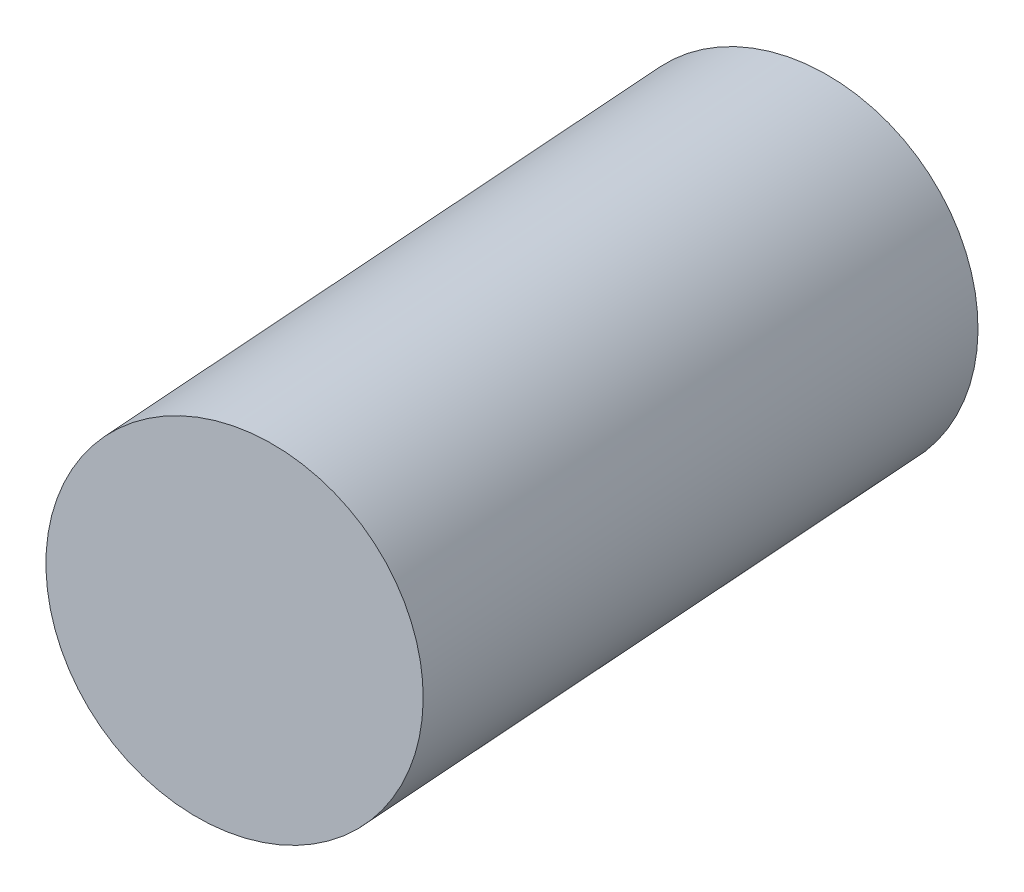
ISO-10303-21;
HEADER;
FILE_DESCRIPTION(('STEP AP214'),'2;1');
FILE_NAME('part.step','',(''),(''),'','','');
FILE_SCHEMA(('AUTOMOTIVE_DESIGN { 1 0 10303 214 1 1 1 1 }'));
ENDSEC;
DATA;
#1=APPLICATION_CONTEXT('core data for automotive mechanical design processes');
#2=APPLICATION_PROTOCOL_DEFINITION('international standard','automotive_design',2000,#1);
#3=PRODUCT_CONTEXT('',#1,'mechanical');
#4=PRODUCT('Part','Part','',(#3));
#5=PRODUCT_RELATED_PRODUCT_CATEGORY('part','',(#4));
#6=PRODUCT_DEFINITION_FORMATION('','',#4);
#7=PRODUCT_DEFINITION_CONTEXT('part definition',#1,'design');
#8=PRODUCT_DEFINITION('design','',#6,#7);
#9=PRODUCT_DEFINITION_SHAPE('','',#8);
#10=(LENGTH_UNIT() NAMED_UNIT(*) SI_UNIT(.MILLI.,.METRE.));
#11=(NAMED_UNIT(*) PLANE_ANGLE_UNIT() SI_UNIT($,.RADIAN.));
#12=(NAMED_UNIT(*) SI_UNIT($,.STERADIAN.) SOLID_ANGLE_UNIT());
#13=UNCERTAINTY_MEASURE_WITH_UNIT(LENGTH_MEASURE(1.E-05),#10,'distance_accuracy_value','');
#14=(GEOMETRIC_REPRESENTATION_CONTEXT(3) GLOBAL_UNCERTAINTY_ASSIGNED_CONTEXT((#13)) GLOBAL_UNIT_ASSIGNED_CONTEXT((#10,
#11,#12)) REPRESENTATION_CONTEXT('',''));
#15=CARTESIAN_POINT('',(0.,0.,0.));
#16=DIRECTION('',(0.,0.,1.));
#17=DIRECTION('',(1.,0.,0.));
#18=AXIS2_PLACEMENT_3D('',#15,#16,#17);
#19=CARTESIAN_POINT('',(-9.4626553381323,-5.46326660671922,5.55625000000001));
#20=DIRECTION('',(0.150383733180434,0.0868240888334623,0.984807753012209));
#21=DIRECTION('',(0.852868531952448,0.492403876506097,-0.173648177666928));
#22=AXIS2_PLACEMENT_3D('',#19,#20,#21);
#23=CYLINDRICAL_SURFACE('',#22,1.93220030269667);
#24=CARTESIAN_POINT('',(-9.6264649875565,-5.55784215191013,4.48352085995661));
#25=DIRECTION('',(0.150383733180434,0.0868240888334623,0.984807753012209));
#26=DIRECTION('',(0.852868531952448,0.492403876506097,-0.173648177666928));
#27=AXIS2_PLACEMENT_3D('',#24,#25,#26);
#28=CIRCLE('',#27,1.93220030269667);
#29=CARTESIAN_POINT('',(-7.97855215195752,-4.60641923267604,4.14799779850585));
#30=VERTEX_POINT('',#29);
#31=EDGE_CURVE('E22',#30,#30,#28,.T.);
#32=ORIENTED_EDGE('',*,*,#31,.F.);
#33=EDGE_LOOP('',(#32));
#34=FACE_BOUND('',#33,.T.);
#35=CARTESIAN_POINT('',(-10.7959490356235,-6.23304408187458,-3.175));
#36=DIRECTION('',(0.150383733180434,0.0868240888334623,0.984807753012209));
#37=DIRECTION('',(0.852868531952448,0.492403876506097,-0.173648177666928));
#38=AXIS2_PLACEMENT_3D('',#35,#36,#37);
#39=CIRCLE('',#38,1.93220030269667);
#40=CARTESIAN_POINT('',(-9.14803620002452,-5.28162116264049,-3.51052306145076));
#41=VERTEX_POINT('',#40);
#42=EDGE_CURVE('E10',#41,#41,#39,.T.);
#43=ORIENTED_EDGE('',*,*,#42,.T.);
#44=EDGE_LOOP('',(#43));
#45=FACE_BOUND('',#44,.T.);
#46=ADVANCED_FACE('F15',(#34,#45),#23,.T.);
#47=CARTESIAN_POINT('',(-9.6264649875565,-5.55784215191013,4.48352085995661));
#48=DIRECTION('',(-0.150383733180434,-0.0868240888334623,-0.984807753012209));
#49=DIRECTION('',(-0.852868531952448,-0.492403876506096,0.173648177666928));
#50=AXIS2_PLACEMENT_3D('',#47,#48,#49);
#51=PLANE('',#50);
#52=ORIENTED_EDGE('',*,*,#31,.T.);
#53=EDGE_LOOP('',(#52));
#54=FACE_BOUND('',#53,.T.);
#55=ADVANCED_FACE('F28',(#54),#51,.F.);
#56=CARTESIAN_POINT('',(-12.4438618712225,-7.18446700110868,-2.83947693854923));
#57=DIRECTION('',(0.150383733180434,0.0868240888334623,0.984807753012209));
#58=DIRECTION('',(0.852868531952448,0.492403876506096,-0.173648177666928));
#59=AXIS2_PLACEMENT_3D('',#56,#57,#58);
#60=PLANE('',#59);
#61=ORIENTED_EDGE('',*,*,#42,.F.);
#62=EDGE_LOOP('',(#61));
#63=FACE_BOUND('',#62,.T.);
#64=ADVANCED_FACE('F17',(#63),#60,.F.);
#65=CLOSED_SHELL('',(#46,#55,#64));
#66=MANIFOLD_SOLID_BREP('B1',#65);
#67=ADVANCED_BREP_SHAPE_REPRESENTATION('',(#18,#66),#14);
#68=SHAPE_DEFINITION_REPRESENTATION(#9,#67);
ENDSEC;
END-ISO-10303-21;
